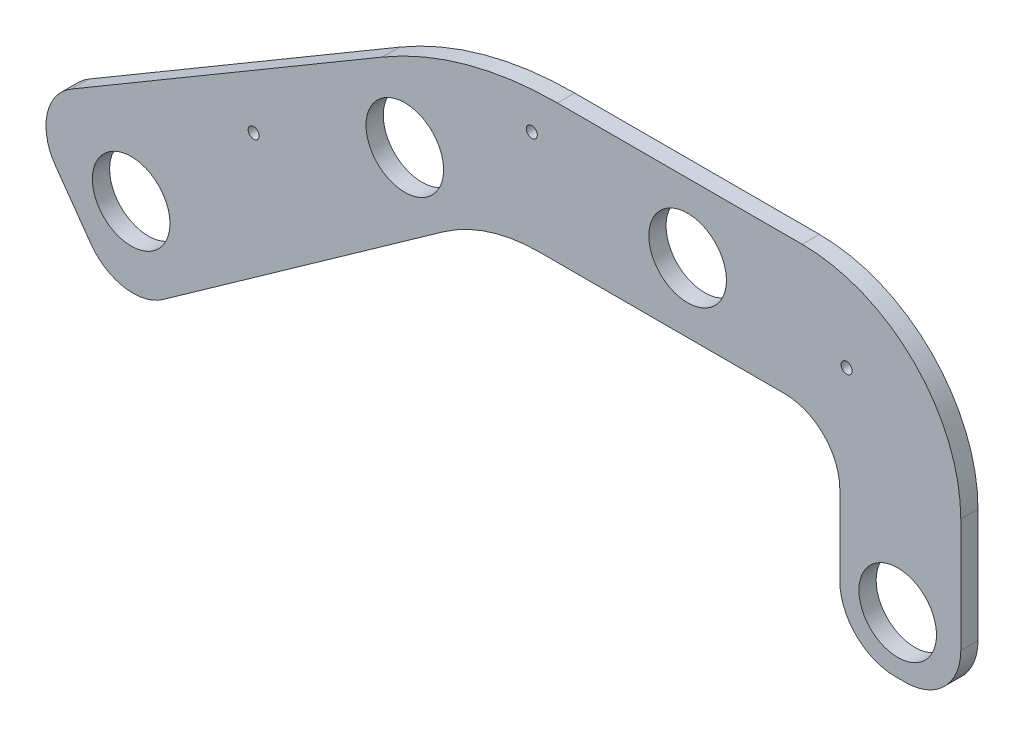
ISO-10303-21;
HEADER;
FILE_DESCRIPTION(('STEP AP214'),'2;1');
FILE_NAME('part.step','',(''),(''),'','','');
FILE_SCHEMA(('AUTOMOTIVE_DESIGN { 1 0 10303 214 1 1 1 1 }'));
ENDSEC;
DATA;
#1=APPLICATION_CONTEXT('core data for automotive mechanical design processes');
#2=APPLICATION_PROTOCOL_DEFINITION('international standard','automotive_design',2000,#1);
#3=PRODUCT_CONTEXT('',#1,'mechanical');
#4=PRODUCT('Part','Part','',(#3));
#5=PRODUCT_RELATED_PRODUCT_CATEGORY('part','',(#4));
#6=PRODUCT_DEFINITION_FORMATION('','',#4);
#7=PRODUCT_DEFINITION_CONTEXT('part definition',#1,'design');
#8=PRODUCT_DEFINITION('design','',#6,#7);
#9=PRODUCT_DEFINITION_SHAPE('','',#8);
#10=(LENGTH_UNIT() NAMED_UNIT(*) SI_UNIT(.MILLI.,.METRE.));
#11=(NAMED_UNIT(*) PLANE_ANGLE_UNIT() SI_UNIT($,.RADIAN.));
#12=(NAMED_UNIT(*) SI_UNIT($,.STERADIAN.) SOLID_ANGLE_UNIT());
#13=UNCERTAINTY_MEASURE_WITH_UNIT(LENGTH_MEASURE(1.E-05),#10,'distance_accuracy_value','');
#14=(GEOMETRIC_REPRESENTATION_CONTEXT(3) GLOBAL_UNCERTAINTY_ASSIGNED_CONTEXT((#13)) GLOBAL_UNIT_ASSIGNED_CONTEXT((#10,
#11,#12)) REPRESENTATION_CONTEXT('',''));
#15=CARTESIAN_POINT('',(0.,0.,0.));
#16=DIRECTION('',(0.,0.,1.));
#17=DIRECTION('',(1.,0.,0.));
#18=AXIS2_PLACEMENT_3D('',#15,#16,#17);
#19=CARTESIAN_POINT('',(0.,0.,3.175));
#20=DIRECTION('',(0.,1.,0.));
#21=DIRECTION('',(0.,0.,1.));
#22=AXIS2_PLACEMENT_3D('',#19,#20,#21);
#23=PLANE('',#22);
#24=DIRECTION('',(1.,0.,0.));
#25=VECTOR('',#24,1.);
#26=CARTESIAN_POINT('',(0.,0.,0.));
#27=LINE('',#26,#25);
#28=CARTESIAN_POINT('',(19.4186309210851,0.,0.));
#29=VERTEX_POINT('',#28);
#30=CARTESIAN_POINT('',(109.855,0.,0.));
#31=VERTEX_POINT('',#30);
#32=EDGE_CURVE('E276',#29,#31,#27,.T.);
#33=ORIENTED_EDGE('',*,*,#32,.T.);
#34=DIRECTION('',(0.,0.,-1.));
#35=VECTOR('',#34,1.);
#36=CARTESIAN_POINT('',(109.855,0.,6.35));
#37=LINE('',#36,#35);
#38=CARTESIAN_POINT('',(109.855,0.,6.35));
#39=VERTEX_POINT('',#38);
#40=EDGE_CURVE('E215',#31,#39,#37,.F.);
#41=ORIENTED_EDGE('',*,*,#40,.T.);
#42=DIRECTION('',(1.,0.,0.));
#43=VECTOR('',#42,1.);
#44=CARTESIAN_POINT('',(0.,0.,6.35));
#45=LINE('',#44,#43);
#46=CARTESIAN_POINT('',(19.4186309210851,0.,6.35));
#47=VERTEX_POINT('',#46);
#48=EDGE_CURVE('E306',#47,#39,#45,.T.);
#49=ORIENTED_EDGE('',*,*,#48,.F.);
#50=DIRECTION('',(0.,0.,-1.));
#51=VECTOR('',#50,1.);
#52=CARTESIAN_POINT('',(19.4186309210851,0.,0.));
#53=LINE('',#52,#51);
#54=EDGE_CURVE('E203',#47,#29,#53,.T.);
#55=ORIENTED_EDGE('',*,*,#54,.T.);
#56=EDGE_LOOP('',(#33,#41,#49,#55));
#57=FACE_BOUND('',#56,.T.);
#58=ADVANCED_FACE('F38',(#57),#23,.F.);
#59=CARTESIAN_POINT('',(130.175,0.,3.175));
#60=DIRECTION('',(1.,0.,0.));
#61=DIRECTION('',(0.,0.,-1.));
#62=AXIS2_PLACEMENT_3D('',#59,#60,#61);
#63=PLANE('',#62);
#64=DIRECTION('',(0.,-1.,0.));
#65=VECTOR('',#64,1.);
#66=CARTESIAN_POINT('',(130.175,0.,0.));
#67=LINE('',#66,#65);
#68=CARTESIAN_POINT('',(130.175,-20.32,0.));
#69=VERTEX_POINT('',#68);
#70=CARTESIAN_POINT('',(130.175,-49.53,0.));
#71=VERTEX_POINT('',#70);
#72=EDGE_CURVE('E279',#69,#71,#67,.T.);
#73=ORIENTED_EDGE('',*,*,#72,.T.);
#74=DIRECTION('',(0.,0.,-1.));
#75=VECTOR('',#74,1.);
#76=CARTESIAN_POINT('',(130.175,-49.53,3.175));
#77=LINE('',#76,#75);
#78=CARTESIAN_POINT('',(130.175,-49.53,6.35));
#79=VERTEX_POINT('',#78);
#80=EDGE_CURVE('E226',#71,#79,#77,.F.);
#81=ORIENTED_EDGE('',*,*,#80,.T.);
#82=DIRECTION('',(0.,-1.,0.));
#83=VECTOR('',#82,1.);
#84=CARTESIAN_POINT('',(130.175,0.,6.35));
#85=LINE('',#84,#83);
#86=CARTESIAN_POINT('',(130.175,-20.32,6.35));
#87=VERTEX_POINT('',#86);
#88=EDGE_CURVE('E301',#87,#79,#85,.T.);
#89=ORIENTED_EDGE('',*,*,#88,.F.);
#90=DIRECTION('',(0.,0.,-1.));
#91=VECTOR('',#90,1.);
#92=CARTESIAN_POINT('',(130.175,-20.32,0.));
#93=LINE('',#92,#91);
#94=EDGE_CURVE('E212',#87,#69,#93,.T.);
#95=ORIENTED_EDGE('',*,*,#94,.T.);
#96=EDGE_LOOP('',(#73,#81,#89,#95));
#97=FACE_BOUND('',#96,.T.);
#98=ADVANCED_FACE('F386',(#97),#63,.F.);
#99=CARTESIAN_POINT('',(130.175,-69.85,3.175));
#100=DIRECTION('',(0.,1.,0.));
#101=DIRECTION('',(0.,0.,1.));
#102=AXIS2_PLACEMENT_3D('',#99,#100,#101);
#103=PLANE('',#102);
#104=DIRECTION('',(1.,0.,0.));
#105=VECTOR('',#104,1.);
#106=CARTESIAN_POINT('',(130.175,-69.85,0.));
#107=LINE('',#106,#105);
#108=CARTESIAN_POINT('',(150.495,-69.85,0.));
#109=VERTEX_POINT('',#108);
#110=CARTESIAN_POINT('',(154.406114012222,-69.85,0.));
#111=VERTEX_POINT('',#110);
#112=EDGE_CURVE('E253',#109,#111,#107,.T.);
#113=ORIENTED_EDGE('',*,*,#112,.T.);
#114=DIRECTION('',(0.,0.,-1.));
#115=VECTOR('',#114,1.);
#116=CARTESIAN_POINT('',(154.406114012222,-69.85,3.175));
#117=LINE('',#116,#115);
#118=CARTESIAN_POINT('',(154.406114012222,-69.85,6.35));
#119=VERTEX_POINT('',#118);
#120=EDGE_CURVE('E235',#111,#119,#117,.F.);
#121=ORIENTED_EDGE('',*,*,#120,.T.);
#122=DIRECTION('',(1.,0.,0.));
#123=VECTOR('',#122,1.);
#124=CARTESIAN_POINT('',(130.175,-69.85,6.35));
#125=LINE('',#124,#123);
#126=CARTESIAN_POINT('',(150.495,-69.85,6.35));
#127=VERTEX_POINT('',#126);
#128=EDGE_CURVE('E297',#127,#119,#125,.T.);
#129=ORIENTED_EDGE('',*,*,#128,.F.);
#130=DIRECTION('',(0.,0.,-1.));
#131=VECTOR('',#130,1.);
#132=CARTESIAN_POINT('',(150.495,-69.85,3.175));
#133=LINE('',#132,#131);
#134=EDGE_CURVE('E221',#127,#109,#133,.T.);
#135=ORIENTED_EDGE('',*,*,#134,.T.);
#136=EDGE_LOOP('',(#113,#121,#129,#135));
#137=FACE_BOUND('',#136,.T.);
#138=ADVANCED_FACE('F288',(#137),#103,.F.);
#139=CARTESIAN_POINT('',(174.726114012222,-31.75,3.175));
#140=DIRECTION('',(-1.,0.,0.));
#141=DIRECTION('',(0.,0.,1.));
#142=AXIS2_PLACEMENT_3D('',#139,#140,#141);
#143=PLANE('',#142);
#144=DIRECTION('',(0.,1.,0.));
#145=VECTOR('',#144,1.);
#146=CARTESIAN_POINT('',(174.726114012222,-31.75,0.));
#147=LINE('',#146,#145);
#148=CARTESIAN_POINT('',(174.726114012222,-49.53,0.));
#149=VERTEX_POINT('',#148);
#150=CARTESIAN_POINT('',(174.726114012222,-7.55047961395594,0.));
#151=VERTEX_POINT('',#150);
#152=EDGE_CURVE('E250',#149,#151,#147,.T.);
#153=ORIENTED_EDGE('',*,*,#152,.T.);
#154=DIRECTION('',(0.,0.,-1.));
#155=VECTOR('',#154,1.);
#156=CARTESIAN_POINT('',(174.726114012222,-7.55047961395593,3.175));
#157=LINE('',#156,#155);
#158=CARTESIAN_POINT('',(174.726114012222,-7.55047961395595,6.35));
#159=VERTEX_POINT('',#158);
#160=EDGE_CURVE('E46',#151,#159,#157,.F.);
#161=ORIENTED_EDGE('',*,*,#160,.T.);
#162=DIRECTION('',(0.,1.,0.));
#163=VECTOR('',#162,1.);
#164=CARTESIAN_POINT('',(174.726114012222,-69.85,6.35));
#165=LINE('',#164,#163);
#166=CARTESIAN_POINT('',(174.726114012222,-49.53,6.35));
#167=VERTEX_POINT('',#166);
#168=EDGE_CURVE('E296',#167,#159,#165,.T.);
#169=ORIENTED_EDGE('',*,*,#168,.F.);
#170=DIRECTION('',(0.,0.,-1.));
#171=VECTOR('',#170,1.);
#172=CARTESIAN_POINT('',(174.726114012222,-49.53,3.175));
#173=LINE('',#172,#171);
#174=EDGE_CURVE('E230',#167,#149,#173,.T.);
#175=ORIENTED_EDGE('',*,*,#174,.T.);
#176=EDGE_LOOP('',(#153,#161,#169,#175));
#177=FACE_BOUND('',#176,.T.);
#178=ADVANCED_FACE('F298',(#177),#143,.F.);
#179=CARTESIAN_POINT('',(174.726114012222,50.8695203860441,3.175));
#180=DIRECTION('',(0.,-1.,0.));
#181=DIRECTION('',(1.,0.,0.));
#182=AXIS2_PLACEMENT_3D('',#179,#180,#181);
#183=PLANE('',#182);
#184=DIRECTION('',(-1.,0.,0.));
#185=VECTOR('',#184,1.);
#186=CARTESIAN_POINT('',(174.726114012222,50.8695203860441,6.35));
#187=LINE('',#186,#185);
#188=CARTESIAN_POINT('',(116.306114012222,50.8695203860441,6.35));
#189=VERTEX_POINT('',#188);
#190=CARTESIAN_POINT('',(26.1630473942683,50.8695203860441,6.35));
#191=VERTEX_POINT('',#190);
#192=EDGE_CURVE('E157',#189,#191,#187,.T.);
#193=ORIENTED_EDGE('',*,*,#192,.F.);
#194=DIRECTION('',(0.,0.,-1.));
#195=VECTOR('',#194,1.);
#196=CARTESIAN_POINT('',(116.306114012222,50.8695203860441,3.175));
#197=LINE('',#196,#195);
#198=CARTESIAN_POINT('',(116.306114012222,50.8695203860441,0.));
#199=VERTEX_POINT('',#198);
#200=EDGE_CURVE('E239',#189,#199,#197,.T.);
#201=ORIENTED_EDGE('',*,*,#200,.T.);
#202=DIRECTION('',(-1.,0.,0.));
#203=VECTOR('',#202,1.);
#204=CARTESIAN_POINT('',(174.726114012222,50.8695203860441,0.));
#205=LINE('',#204,#203);
#206=CARTESIAN_POINT('',(26.1630473942683,50.8695203860441,0.));
#207=VERTEX_POINT('',#206);
#208=EDGE_CURVE('E245',#199,#207,#205,.T.);
#209=ORIENTED_EDGE('',*,*,#208,.T.);
#210=DIRECTION('',(0.,0.,-1.));
#211=VECTOR('',#210,1.);
#212=CARTESIAN_POINT('',(26.1630473942683,50.8695203860441,3.175));
#213=LINE('',#212,#211);
#214=EDGE_CURVE('E163',#207,#191,#213,.F.);
#215=ORIENTED_EDGE('',*,*,#214,.T.);
#216=EDGE_LOOP('',(#193,#201,#209,#215));
#217=FACE_BOUND('',#216,.T.);
#218=ADVANCED_FACE('F244',(#217),#183,.F.);
#219=CARTESIAN_POINT('',(-170.69993797376,-44.6942356897263,3.175));
#220=DIRECTION('',(0.507527699518037,-0.861635441600407,0.));
#221=DIRECTION('',(0.861635441600408,0.507527699518037,0.));
#222=AXIS2_PLACEMENT_3D('',#219,#220,#221);
#223=PLANE('',#222);
#224=DIRECTION('',(-0.861635441600407,-0.507527699518037,0.));
#225=VECTOR('',#224,1.);
#226=CARTESIAN_POINT('',(-170.69993797376,-44.6942356897263,0.));
#227=LINE('',#226,#225);
#228=CARTESIAN_POINT('',(-38.2929704445223,33.2972214692958,0.));
#229=VERTEX_POINT('',#228);
#230=CARTESIAN_POINT('',(-152.83749231727,-34.1727488588628,0.));
#231=VERTEX_POINT('',#230);
#232=EDGE_CURVE('E249',#229,#231,#227,.T.);
#233=ORIENTED_EDGE('',*,*,#232,.T.);
#234=DIRECTION('',(0.,0.,-1.));
#235=VECTOR('',#234,1.);
#236=CARTESIAN_POINT('',(-152.83749231727,-34.1727488588628,3.175));
#237=LINE('',#236,#235);
#238=CARTESIAN_POINT('',(-152.83749231727,-34.1727488588628,6.35));
#239=VERTEX_POINT('',#238);
#240=EDGE_CURVE('E172',#231,#239,#237,.F.);
#241=ORIENTED_EDGE('',*,*,#240,.T.);
#242=DIRECTION('',(-0.861635441600407,-0.507527699518037,0.));
#243=VECTOR('',#242,1.);
#244=CARTESIAN_POINT('',(-170.69993797376,-44.6942356897263,6.35));
#245=LINE('',#244,#243);
#246=CARTESIAN_POINT('',(-38.2929704445223,33.2972214692958,6.35));
#247=VERTEX_POINT('',#246);
#248=EDGE_CURVE('E154',#247,#239,#245,.T.);
#249=ORIENTED_EDGE('',*,*,#248,.F.);
#250=DIRECTION('',(0.,0.,-1.));
#251=VECTOR('',#250,1.);
#252=CARTESIAN_POINT('',(-38.2929704445223,33.2972214692958,3.175));
#253=LINE('',#252,#251);
#254=EDGE_CURVE('E169',#247,#229,#253,.T.);
#255=ORIENTED_EDGE('',*,*,#254,.T.);
#256=EDGE_LOOP('',(#233,#241,#249,#255));
#257=FACE_BOUND('',#256,.T.);
#258=ADVANCED_FACE('F168',(#257),#223,.F.);
#259=CARTESIAN_POINT('',(-134.680588616307,-95.4942356897263,3.175));
#260=DIRECTION('',(0.815751596706888,0.578402396667028,0.));
#261=DIRECTION('',(-0.578402396667028,0.815751596706888,0.));
#262=AXIS2_PLACEMENT_3D('',#259,#260,#261);
#263=PLANE('',#262);
#264=DIRECTION('',(0.578402396667028,-0.815751596706888,0.));
#265=VECTOR('',#264,1.);
#266=CARTESIAN_POINT('',(-134.680588616307,-95.4942356897263,0.));
#267=LINE('',#266,#265);
#268=CARTESIAN_POINT('',(-158.709157558718,-61.6054696778575,0.));
#269=VERTEX_POINT('',#268);
#270=CARTESIAN_POINT('',(-145.699154272814,-79.9541677724601,0.));
#271=VERTEX_POINT('',#270);
#272=EDGE_CURVE('E182',#269,#271,#267,.T.);
#273=ORIENTED_EDGE('',*,*,#272,.T.);
#274=DIRECTION('',(0.,0.,-1.));
#275=VECTOR('',#274,1.);
#276=CARTESIAN_POINT('',(-145.699154272814,-79.9541677724601,3.175));
#277=LINE('',#276,#275);
#278=CARTESIAN_POINT('',(-145.699154272814,-79.9541677724601,6.35));
#279=VERTEX_POINT('',#278);
#280=EDGE_CURVE('E199',#271,#279,#277,.F.);
#281=ORIENTED_EDGE('',*,*,#280,.T.);
#282=DIRECTION('',(0.578402396667028,-0.815751596706888,0.));
#283=VECTOR('',#282,1.);
#284=CARTESIAN_POINT('',(-134.680588616307,-95.4942356897263,6.35));
#285=LINE('',#284,#283);
#286=CARTESIAN_POINT('',(-158.709157558718,-61.6054696778575,6.35));
#287=VERTEX_POINT('',#286);
#288=EDGE_CURVE('E173',#287,#279,#285,.T.);
#289=ORIENTED_EDGE('',*,*,#288,.F.);
#290=DIRECTION('',(0.,0.,-1.));
#291=VECTOR('',#290,1.);
#292=CARTESIAN_POINT('',(-158.709157558718,-61.6054696778574,3.175));
#293=LINE('',#292,#291);
#294=EDGE_CURVE('E162',#287,#269,#293,.T.);
#295=ORIENTED_EDGE('',*,*,#294,.T.);
#296=EDGE_LOOP('',(#273,#281,#289,#295));
#297=FACE_BOUND('',#296,.T.);
#298=ADVANCED_FACE('F260',(#297),#263,.F.);
#299=CARTESIAN_POINT('',(0.,0.,3.175));
#300=DIRECTION('',(-0.578402396667028,0.815751596706888,0.));
#301=DIRECTION('',(-0.815751596706888,-0.578402396667028,0.));
#302=AXIS2_PLACEMENT_3D('',#299,#300,#301);
#303=PLANE('',#302);
#304=DIRECTION('',(0.815751596706888,0.578402396667028,0.));
#305=VECTOR('',#304,1.);
#306=CARTESIAN_POINT('',(0.,0.,0.));
#307=LINE('',#306,#305);
#308=CARTESIAN_POINT('',(-119.140520699041,-84.4756700332195,0.));
#309=VERTEX_POINT('',#308);
#310=CARTESIAN_POINT('',(-15.8407791797369,-11.2317826647481,0.));
#311=VERTEX_POINT('',#310);
#312=EDGE_CURVE('E178',#309,#311,#307,.T.);
#313=ORIENTED_EDGE('',*,*,#312,.T.);
#314=DIRECTION('',(0.,0.,-1.));
#315=VECTOR('',#314,1.);
#316=CARTESIAN_POINT('',(-15.8407791797369,-11.2317826647481,6.35));
#317=LINE('',#316,#315);
#318=CARTESIAN_POINT('',(-15.8407791797369,-11.2317826647481,6.35));
#319=VERTEX_POINT('',#318);
#320=EDGE_CURVE('E206',#311,#319,#317,.F.);
#321=ORIENTED_EDGE('',*,*,#320,.T.);
#322=DIRECTION('',(0.815751596706888,0.578402396667028,0.));
#323=VECTOR('',#322,1.);
#324=CARTESIAN_POINT('',(0.,0.,6.35));
#325=LINE('',#324,#323);
#326=CARTESIAN_POINT('',(-119.140520699041,-84.4756700332195,6.35));
#327=VERTEX_POINT('',#326);
#328=EDGE_CURVE('E270',#327,#319,#325,.T.);
#329=ORIENTED_EDGE('',*,*,#328,.F.);
#330=DIRECTION('',(0.,0.,-1.));
#331=VECTOR('',#330,1.);
#332=CARTESIAN_POINT('',(-119.140520699041,-84.4756700332195,3.175));
#333=LINE('',#332,#331);
#334=EDGE_CURVE('E194',#327,#309,#333,.T.);
#335=ORIENTED_EDGE('',*,*,#334,.T.);
#336=EDGE_LOOP('',(#313,#321,#329,#335));
#337=FACE_BOUND('',#336,.T.);
#338=ADVANCED_FACE('F273',(#337),#303,.F.);
#339=CARTESIAN_POINT('',(0.,0.,0.));
#340=DIRECTION('',(0.,0.,-1.));
#341=DIRECTION('',(-1.,0.,0.));
#342=AXIS2_PLACEMENT_3D('',#339,#340,#341);
#343=PLANE('',#342);
#344=CARTESIAN_POINT('',(-30.0550304667695,8.56300737602567,0.));
#345=DIRECTION('',(0.,0.,-1.));
#346=DIRECTION('',(-1.,0.,0.));
#347=AXIS2_PLACEMENT_3D('',#344,#345,#346);
#348=CIRCLE('',#347,14.2875);
#349=CARTESIAN_POINT('',(-44.3425304667695,8.56300737602567,0.));
#350=VERTEX_POINT('',#349);
#351=EDGE_CURVE('E328',#350,#350,#348,.T.);
#352=ORIENTED_EDGE('',*,*,#351,.F.);
#353=EDGE_LOOP('',(#352));
#354=FACE_BOUND('',#353,.T.);
#355=CARTESIAN_POINT('',(151.503295523505,-49.0244770410215,0.));
#356=DIRECTION('',(0.,0.,-1.));
#357=DIRECTION('',(-1.,0.,0.));
#358=AXIS2_PLACEMENT_3D('',#355,#356,#357);
#359=CIRCLE('',#358,14.2875);
#360=CARTESIAN_POINT('',(137.215795523505,-49.0244770410215,0.));
#361=VERTEX_POINT('',#360);
#362=EDGE_CURVE('E335',#361,#361,#359,.T.);
#363=ORIENTED_EDGE('',*,*,#362,.F.);
#364=EDGE_LOOP('',(#363));
#365=FACE_BOUND('',#364,.T.);
#366=CARTESIAN_POINT('',(132.677584994468,19.6767864826342,0.));
#367=DIRECTION('',(0.,0.,-1.));
#368=DIRECTION('',(-1.,0.,0.));
#369=AXIS2_PLACEMENT_3D('',#366,#367,#368);
#370=CIRCLE('',#369,2.03200000000001);
#371=CARTESIAN_POINT('',(130.645584994468,19.6767864826342,0.));
#372=VERTEX_POINT('',#371);
#373=EDGE_CURVE('E316',#372,#372,#370,.T.);
#374=ORIENTED_EDGE('',*,*,#373,.F.);
#375=EDGE_LOOP('',(#374));
#376=FACE_BOUND('',#375,.T.);
#377=CARTESIAN_POINT('',(74.1123588019121,25.4,0.));
#378=DIRECTION('',(0.,0.,-1.));
#379=DIRECTION('',(-1.,0.,0.));
#380=AXIS2_PLACEMENT_3D('',#377,#378,#379);
#381=CIRCLE('',#380,14.2875);
#382=CARTESIAN_POINT('',(59.8248588019121,25.4,0.));
#383=VERTEX_POINT('',#382);
#384=EDGE_CURVE('E323',#383,#383,#381,.T.);
#385=ORIENTED_EDGE('',*,*,#384,.F.);
#386=EDGE_LOOP('',(#385));
#387=FACE_BOUND('',#386,.T.);
#388=CARTESIAN_POINT('',(16.7302955438089,36.9179557453165,0.));
#389=DIRECTION('',(0.,0.,-1.));
#390=DIRECTION('',(-1.,0.,0.));
#391=AXIS2_PLACEMENT_3D('',#388,#389,#390);
#392=CIRCLE('',#391,2.032);
#393=CARTESIAN_POINT('',(14.6982955438089,36.9179557453165,0.));
#394=VERTEX_POINT('',#393);
#395=EDGE_CURVE('E346',#394,#394,#392,.T.);
#396=ORIENTED_EDGE('',*,*,#395,.F.);
#397=EDGE_LOOP('',(#396));
#398=FACE_BOUND('',#397,.T.);
#399=CARTESIAN_POINT('',(-130.843837194959,-58.9846908851968,0.));
#400=DIRECTION('',(0.,0.,-1.));
#401=DIRECTION('',(-1.,0.,0.));
#402=AXIS2_PLACEMENT_3D('',#399,#400,#401);
#403=CIRCLE('',#402,14.2875);
#404=CARTESIAN_POINT('',(-145.131337194959,-58.9846908851968,0.));
#405=VERTEX_POINT('',#404);
#406=EDGE_CURVE('E340',#405,#405,#403,.T.);
#407=ORIENTED_EDGE('',*,*,#406,.F.);
#408=EDGE_LOOP('',(#407));
#409=FACE_BOUND('',#408,.T.);
#410=CARTESIAN_POINT('',(-85.7283583978798,-14.6121084220283,0.));
#411=DIRECTION('',(0.,0.,-1.));
#412=DIRECTION('',(-1.,0.,0.));
#413=AXIS2_PLACEMENT_3D('',#410,#411,#412);
#414=CIRCLE('',#413,2.03200000000001);
#415=CARTESIAN_POINT('',(-87.7603583978799,-14.6121084220283,0.));
#416=VERTEX_POINT('',#415);
#417=EDGE_CURVE('E310',#416,#416,#414,.T.);
#418=ORIENTED_EDGE('',*,*,#417,.F.);
#419=EDGE_LOOP('',(#418));
#420=FACE_BOUND('',#419,.T.);
#421=ORIENTED_EDGE('',*,*,#208,.F.);
#422=CARTESIAN_POINT('',(116.306114012222,-7.55047961395593,0.));
#423=DIRECTION('',(0.,0.,-1.));
#424=DIRECTION('',(-1.,0.,0.));
#425=AXIS2_PLACEMENT_3D('',#422,#423,#424);
#426=CIRCLE('',#425,58.42);
#427=EDGE_CURVE('E60',#199,#151,#426,.T.);
#428=ORIENTED_EDGE('',*,*,#427,.T.);
#429=ORIENTED_EDGE('',*,*,#152,.F.);
#430=CARTESIAN_POINT('',(154.406114012222,-49.53,0.));
#431=DIRECTION('',(0.,0.,-1.));
#432=DIRECTION('',(-1.,0.,0.));
#433=AXIS2_PLACEMENT_3D('',#430,#431,#432);
#434=CIRCLE('',#433,20.32);
#435=EDGE_CURVE('E233',#149,#111,#434,.T.);
#436=ORIENTED_EDGE('',*,*,#435,.T.);
#437=ORIENTED_EDGE('',*,*,#112,.F.);
#438=CARTESIAN_POINT('',(150.495,-49.53,0.));
#439=DIRECTION('',(0.,0.,-1.));
#440=DIRECTION('',(-1.,0.,0.));
#441=AXIS2_PLACEMENT_3D('',#438,#439,#440);
#442=CIRCLE('',#441,20.32);
#443=EDGE_CURVE('E224',#109,#71,#442,.T.);
#444=ORIENTED_EDGE('',*,*,#443,.T.);
#445=ORIENTED_EDGE('',*,*,#72,.F.);
#446=CARTESIAN_POINT('',(109.855,-20.32,0.));
#447=DIRECTION('',(0.,0.,-1.));
#448=DIRECTION('',(-1.,0.,0.));
#449=AXIS2_PLACEMENT_3D('',#446,#447,#448);
#450=CIRCLE('',#449,20.32);
#451=EDGE_CURVE('E217',#69,#31,#450,.F.);
#452=ORIENTED_EDGE('',*,*,#451,.T.);
#453=ORIENTED_EDGE('',*,*,#32,.F.);
#454=CARTESIAN_POINT('',(19.4186309210851,-60.96,0.));
#455=DIRECTION('',(0.,0.,-1.));
#456=DIRECTION('',(-1.,0.,0.));
#457=AXIS2_PLACEMENT_3D('',#454,#455,#456);
#458=CIRCLE('',#457,60.96);
#459=EDGE_CURVE('E208',#29,#311,#458,.F.);
#460=ORIENTED_EDGE('',*,*,#459,.T.);
#461=ORIENTED_EDGE('',*,*,#312,.F.);
#462=CARTESIAN_POINT('',(-130.159086355548,-68.9356021159532,0.));
#463=DIRECTION('',(0.,0.,-1.));
#464=DIRECTION('',(-1.,0.,0.));
#465=AXIS2_PLACEMENT_3D('',#462,#463,#464);
#466=CIRCLE('',#465,19.05);
#467=EDGE_CURVE('E197',#309,#271,#466,.T.);
#468=ORIENTED_EDGE('',*,*,#467,.T.);
#469=ORIENTED_EDGE('',*,*,#272,.F.);
#470=CARTESIAN_POINT('',(-143.169089641452,-50.5869040213505,0.));
#471=DIRECTION('',(0.,0.,-1.));
#472=DIRECTION('',(-1.,0.,0.));
#473=AXIS2_PLACEMENT_3D('',#470,#471,#472);
#474=CIRCLE('',#473,19.05);
#475=EDGE_CURVE('E189',#269,#231,#474,.T.);
#476=ORIENTED_EDGE('',*,*,#475,.T.);
#477=ORIENTED_EDGE('',*,*,#232,.F.);
#478=CARTESIAN_POINT('',(26.1630473942684,-76.1304796139559,0.));
#479=DIRECTION('',(0.,0.,-1.));
#480=DIRECTION('',(-1.,0.,0.));
#481=AXIS2_PLACEMENT_3D('',#478,#479,#480);
#482=CIRCLE('',#481,127.);
#483=EDGE_CURVE('E177',#229,#207,#482,.T.);
#484=ORIENTED_EDGE('',*,*,#483,.T.);
#485=EDGE_LOOP('',(#421,#428,#429,#436,#437,#444,#445,#452,#453,#460,#461,#468,#469,#476,#477,#484));
#486=FACE_BOUND('',#485,.T.);
#487=ADVANCED_FACE('F248',(#354,#365,#376,#387,#398,#409,#420,#486),#343,.T.);
#488=CARTESIAN_POINT('',(0.,0.,6.35));
#489=DIRECTION('',(0.,0.,-1.));
#490=DIRECTION('',(-1.,0.,0.));
#491=AXIS2_PLACEMENT_3D('',#488,#489,#490);
#492=PLANE('',#491);
#493=CARTESIAN_POINT('',(-30.0550304667695,8.56300737602567,6.35));
#494=DIRECTION('',(0.,0.,-1.));
#495=DIRECTION('',(-1.,0.,0.));
#496=AXIS2_PLACEMENT_3D('',#493,#494,#495);
#497=CIRCLE('',#496,14.2875);
#498=CARTESIAN_POINT('',(-44.3425304667695,8.56300737602567,6.35));
#499=VERTEX_POINT('',#498);
#500=EDGE_CURVE('E331',#499,#499,#497,.T.);
#501=ORIENTED_EDGE('',*,*,#500,.T.);
#502=EDGE_LOOP('',(#501));
#503=FACE_BOUND('',#502,.T.);
#504=CARTESIAN_POINT('',(151.503295523505,-49.0244770410215,6.35));
#505=DIRECTION('',(0.,0.,-1.));
#506=DIRECTION('',(-1.,0.,0.));
#507=AXIS2_PLACEMENT_3D('',#504,#505,#506);
#508=CIRCLE('',#507,14.2875);
#509=CARTESIAN_POINT('',(137.215795523505,-49.0244770410215,6.35));
#510=VERTEX_POINT('',#509);
#511=EDGE_CURVE('E320',#510,#510,#508,.T.);
#512=ORIENTED_EDGE('',*,*,#511,.T.);
#513=EDGE_LOOP('',(#512));
#514=FACE_BOUND('',#513,.T.);
#515=CARTESIAN_POINT('',(132.677584994468,19.6767864826342,6.35));
#516=DIRECTION('',(0.,0.,-1.));
#517=DIRECTION('',(-1.,0.,0.));
#518=AXIS2_PLACEMENT_3D('',#515,#516,#517);
#519=CIRCLE('',#518,2.03200000000001);
#520=CARTESIAN_POINT('',(130.645584994468,19.6767864826342,6.35));
#521=VERTEX_POINT('',#520);
#522=EDGE_CURVE('E319',#521,#521,#519,.T.);
#523=ORIENTED_EDGE('',*,*,#522,.T.);
#524=EDGE_LOOP('',(#523));
#525=FACE_BOUND('',#524,.T.);
#526=CARTESIAN_POINT('',(74.1123588019121,25.4,6.35));
#527=DIRECTION('',(0.,0.,-1.));
#528=DIRECTION('',(-1.,0.,0.));
#529=AXIS2_PLACEMENT_3D('',#526,#527,#528);
#530=CIRCLE('',#529,14.2875);
#531=CARTESIAN_POINT('',(59.8248588019121,25.4,6.35));
#532=VERTEX_POINT('',#531);
#533=EDGE_CURVE('E313',#532,#532,#530,.T.);
#534=ORIENTED_EDGE('',*,*,#533,.T.);
#535=EDGE_LOOP('',(#534));
#536=FACE_BOUND('',#535,.T.);
#537=CARTESIAN_POINT('',(16.7302955438089,36.9179557453165,6.35));
#538=DIRECTION('',(0.,0.,-1.));
#539=DIRECTION('',(-1.,0.,0.));
#540=AXIS2_PLACEMENT_3D('',#537,#538,#539);
#541=CIRCLE('',#540,2.032);
#542=CARTESIAN_POINT('',(14.6982955438089,36.9179557453165,6.35));
#543=VERTEX_POINT('',#542);
#544=EDGE_CURVE('E332',#543,#543,#541,.T.);
#545=ORIENTED_EDGE('',*,*,#544,.T.);
#546=EDGE_LOOP('',(#545));
#547=FACE_BOUND('',#546,.T.);
#548=CARTESIAN_POINT('',(-130.843837194959,-58.9846908851968,6.35));
#549=DIRECTION('',(0.,0.,-1.));
#550=DIRECTION('',(-1.,0.,0.));
#551=AXIS2_PLACEMENT_3D('',#548,#549,#550);
#552=CIRCLE('',#551,14.2875);
#553=CARTESIAN_POINT('',(-145.131337194959,-58.9846908851968,6.35));
#554=VERTEX_POINT('',#553);
#555=EDGE_CURVE('E343',#554,#554,#552,.T.);
#556=ORIENTED_EDGE('',*,*,#555,.T.);
#557=EDGE_LOOP('',(#556));
#558=FACE_BOUND('',#557,.T.);
#559=CARTESIAN_POINT('',(-85.7283583978798,-14.6121084220283,6.35));
#560=DIRECTION('',(0.,0.,-1.));
#561=DIRECTION('',(-1.,0.,0.));
#562=AXIS2_PLACEMENT_3D('',#559,#560,#561);
#563=CIRCLE('',#562,2.03200000000001);
#564=CARTESIAN_POINT('',(-87.7603583978799,-14.6121084220283,6.35));
#565=VERTEX_POINT('',#564);
#566=EDGE_CURVE('E309',#565,#565,#563,.T.);
#567=ORIENTED_EDGE('',*,*,#566,.T.);
#568=EDGE_LOOP('',(#567));
#569=FACE_BOUND('',#568,.T.);
#570=ORIENTED_EDGE('',*,*,#168,.T.);
#571=CARTESIAN_POINT('',(116.306114012222,-7.55047961395593,6.35));
#572=DIRECTION('',(0.,0.,-1.));
#573=DIRECTION('',(-1.,0.,0.));
#574=AXIS2_PLACEMENT_3D('',#571,#572,#573);
#575=CIRCLE('',#574,58.42);
#576=EDGE_CURVE('E11',#159,#189,#575,.F.);
#577=ORIENTED_EDGE('',*,*,#576,.T.);
#578=ORIENTED_EDGE('',*,*,#192,.T.);
#579=CARTESIAN_POINT('',(26.1630473942684,-76.1304796139559,6.35));
#580=DIRECTION('',(0.,0.,-1.));
#581=DIRECTION('',(-1.,0.,0.));
#582=AXIS2_PLACEMENT_3D('',#579,#580,#581);
#583=CIRCLE('',#582,127.);
#584=EDGE_CURVE('E151',#191,#247,#583,.F.);
#585=ORIENTED_EDGE('',*,*,#584,.T.);
#586=ORIENTED_EDGE('',*,*,#248,.T.);
#587=CARTESIAN_POINT('',(-143.169089641452,-50.5869040213505,6.35));
#588=DIRECTION('',(0.,0.,-1.));
#589=DIRECTION('',(-1.,0.,0.));
#590=AXIS2_PLACEMENT_3D('',#587,#588,#589);
#591=CIRCLE('',#590,19.05);
#592=EDGE_CURVE('E192',#239,#287,#591,.F.);
#593=ORIENTED_EDGE('',*,*,#592,.T.);
#594=ORIENTED_EDGE('',*,*,#288,.T.);
#595=CARTESIAN_POINT('',(-130.159086355548,-68.9356021159532,6.35));
#596=DIRECTION('',(0.,0.,-1.));
#597=DIRECTION('',(-1.,0.,0.));
#598=AXIS2_PLACEMENT_3D('',#595,#596,#597);
#599=CIRCLE('',#598,19.05);
#600=EDGE_CURVE('E201',#279,#327,#599,.F.);
#601=ORIENTED_EDGE('',*,*,#600,.T.);
#602=ORIENTED_EDGE('',*,*,#328,.T.);
#603=CARTESIAN_POINT('',(19.4186309210851,-60.96,6.35));
#604=DIRECTION('',(0.,0.,-1.));
#605=DIRECTION('',(-1.,0.,0.));
#606=AXIS2_PLACEMENT_3D('',#603,#604,#605);
#607=CIRCLE('',#606,60.96);
#608=EDGE_CURVE('E210',#319,#47,#607,.T.);
#609=ORIENTED_EDGE('',*,*,#608,.T.);
#610=ORIENTED_EDGE('',*,*,#48,.T.);
#611=CARTESIAN_POINT('',(109.855,-20.32,6.35));
#612=DIRECTION('',(0.,0.,-1.));
#613=DIRECTION('',(-1.,0.,0.));
#614=AXIS2_PLACEMENT_3D('',#611,#612,#613);
#615=CIRCLE('',#614,20.32);
#616=EDGE_CURVE('E219',#39,#87,#615,.T.);
#617=ORIENTED_EDGE('',*,*,#616,.T.);
#618=ORIENTED_EDGE('',*,*,#88,.T.);
#619=CARTESIAN_POINT('',(150.495,-49.53,6.35));
#620=DIRECTION('',(0.,0.,-1.));
#621=DIRECTION('',(-1.,0.,0.));
#622=AXIS2_PLACEMENT_3D('',#619,#620,#621);
#623=CIRCLE('',#622,20.32);
#624=EDGE_CURVE('E228',#79,#127,#623,.F.);
#625=ORIENTED_EDGE('',*,*,#624,.T.);
#626=ORIENTED_EDGE('',*,*,#128,.T.);
#627=CARTESIAN_POINT('',(154.406114012222,-49.53,6.35));
#628=DIRECTION('',(0.,0.,-1.));
#629=DIRECTION('',(-1.,0.,0.));
#630=AXIS2_PLACEMENT_3D('',#627,#628,#629);
#631=CIRCLE('',#630,20.32);
#632=EDGE_CURVE('E237',#119,#167,#631,.F.);
#633=ORIENTED_EDGE('',*,*,#632,.T.);
#634=EDGE_LOOP('',(#570,#577,#578,#585,#586,#593,#594,#601,#602,#609,#610,#617,#618,#625,#626,#633));
#635=FACE_BOUND('',#634,.T.);
#636=ADVANCED_FACE('F153',(#503,#514,#525,#536,#547,#558,#569,#635),#492,.F.);
#637=CARTESIAN_POINT('',(26.1630473942684,-76.1304796139559,3.175));
#638=DIRECTION('',(0.,0.,-1.));
#639=DIRECTION('',(-1.,0.,0.));
#640=AXIS2_PLACEMENT_3D('',#637,#638,#639);
#641=CYLINDRICAL_SURFACE('',#640,127.);
#642=ORIENTED_EDGE('',*,*,#584,.F.);
#643=ORIENTED_EDGE('',*,*,#214,.F.);
#644=ORIENTED_EDGE('',*,*,#483,.F.);
#645=ORIENTED_EDGE('',*,*,#254,.F.);
#646=EDGE_LOOP('',(#642,#643,#644,#645));
#647=FACE_BOUND('',#646,.T.);
#648=ADVANCED_FACE('F175',(#647),#641,.T.);
#649=CARTESIAN_POINT('',(-143.169089641452,-50.5869040213505,3.175));
#650=DIRECTION('',(0.,0.,-1.));
#651=DIRECTION('',(-1.,0.,0.));
#652=AXIS2_PLACEMENT_3D('',#649,#650,#651);
#653=CYLINDRICAL_SURFACE('',#652,19.05);
#654=ORIENTED_EDGE('',*,*,#592,.F.);
#655=ORIENTED_EDGE('',*,*,#240,.F.);
#656=ORIENTED_EDGE('',*,*,#475,.F.);
#657=ORIENTED_EDGE('',*,*,#294,.F.);
#658=EDGE_LOOP('',(#654,#655,#656,#657));
#659=FACE_BOUND('',#658,.T.);
#660=ADVANCED_FACE('F380',(#659),#653,.T.);
#661=CARTESIAN_POINT('',(-130.159086355548,-68.9356021159532,3.175));
#662=DIRECTION('',(0.,0.,-1.));
#663=DIRECTION('',(-1.,0.,0.));
#664=AXIS2_PLACEMENT_3D('',#661,#662,#663);
#665=CYLINDRICAL_SURFACE('',#664,19.05);
#666=ORIENTED_EDGE('',*,*,#600,.F.);
#667=ORIENTED_EDGE('',*,*,#280,.F.);
#668=ORIENTED_EDGE('',*,*,#467,.F.);
#669=ORIENTED_EDGE('',*,*,#334,.F.);
#670=EDGE_LOOP('',(#666,#667,#668,#669));
#671=FACE_BOUND('',#670,.T.);
#672=ADVANCED_FACE('F266',(#671),#665,.T.);
#673=CARTESIAN_POINT('',(-85.7283583978798,-14.6121084220283,6.35));
#674=DIRECTION('',(0.,0.,-1.));
#675=DIRECTION('',(-1.,0.,0.));
#676=AXIS2_PLACEMENT_3D('',#673,#674,#675);
#677=CYLINDRICAL_SURFACE('',#676,2.03200000000001);
#678=ORIENTED_EDGE('',*,*,#566,.F.);
#679=EDGE_LOOP('',(#678));
#680=FACE_BOUND('',#679,.T.);
#681=ORIENTED_EDGE('',*,*,#417,.T.);
#682=EDGE_LOOP('',(#681));
#683=FACE_BOUND('',#682,.T.);
#684=ADVANCED_FACE('F370',(#680,#683),#677,.F.);
#685=CARTESIAN_POINT('',(-130.843837194959,-58.9846908851968,6.35));
#686=DIRECTION('',(0.,0.,-1.));
#687=DIRECTION('',(-1.,0.,0.));
#688=AXIS2_PLACEMENT_3D('',#685,#686,#687);
#689=CYLINDRICAL_SURFACE('',#688,14.2875);
#690=ORIENTED_EDGE('',*,*,#555,.F.);
#691=EDGE_LOOP('',(#690));
#692=FACE_BOUND('',#691,.T.);
#693=ORIENTED_EDGE('',*,*,#406,.T.);
#694=EDGE_LOOP('',(#693));
#695=FACE_BOUND('',#694,.T.);
#696=ADVANCED_FACE('F358',(#692,#695),#689,.F.);
#697=CARTESIAN_POINT('',(16.7302955438089,36.9179557453165,6.35));
#698=DIRECTION('',(0.,0.,-1.));
#699=DIRECTION('',(-1.,0.,0.));
#700=AXIS2_PLACEMENT_3D('',#697,#698,#699);
#701=CYLINDRICAL_SURFACE('',#700,2.032);
#702=ORIENTED_EDGE('',*,*,#544,.F.);
#703=EDGE_LOOP('',(#702));
#704=FACE_BOUND('',#703,.T.);
#705=ORIENTED_EDGE('',*,*,#395,.T.);
#706=EDGE_LOOP('',(#705));
#707=FACE_BOUND('',#706,.T.);
#708=ADVANCED_FACE('F354',(#704,#707),#701,.F.);
#709=CARTESIAN_POINT('',(74.1123588019121,25.4,6.35));
#710=DIRECTION('',(0.,0.,-1.));
#711=DIRECTION('',(-1.,0.,0.));
#712=AXIS2_PLACEMENT_3D('',#709,#710,#711);
#713=CYLINDRICAL_SURFACE('',#712,14.2875);
#714=ORIENTED_EDGE('',*,*,#533,.F.);
#715=EDGE_LOOP('',(#714));
#716=FACE_BOUND('',#715,.T.);
#717=ORIENTED_EDGE('',*,*,#384,.T.);
#718=EDGE_LOOP('',(#717));
#719=FACE_BOUND('',#718,.T.);
#720=ADVANCED_FACE('F357',(#716,#719),#713,.F.);
#721=CARTESIAN_POINT('',(132.677584994468,19.6767864826342,6.35));
#722=DIRECTION('',(0.,0.,-1.));
#723=DIRECTION('',(-1.,0.,0.));
#724=AXIS2_PLACEMENT_3D('',#721,#722,#723);
#725=CYLINDRICAL_SURFACE('',#724,2.03200000000001);
#726=ORIENTED_EDGE('',*,*,#522,.F.);
#727=EDGE_LOOP('',(#726));
#728=FACE_BOUND('',#727,.T.);
#729=ORIENTED_EDGE('',*,*,#373,.T.);
#730=EDGE_LOOP('',(#729));
#731=FACE_BOUND('',#730,.T.);
#732=ADVANCED_FACE('F527',(#728,#731),#725,.F.);
#733=CARTESIAN_POINT('',(151.503295523505,-49.0244770410215,6.35));
#734=DIRECTION('',(0.,0.,-1.));
#735=DIRECTION('',(-1.,0.,0.));
#736=AXIS2_PLACEMENT_3D('',#733,#734,#735);
#737=CYLINDRICAL_SURFACE('',#736,14.2875);
#738=ORIENTED_EDGE('',*,*,#511,.F.);
#739=EDGE_LOOP('',(#738));
#740=FACE_BOUND('',#739,.T.);
#741=ORIENTED_EDGE('',*,*,#362,.T.);
#742=EDGE_LOOP('',(#741));
#743=FACE_BOUND('',#742,.T.);
#744=ADVANCED_FACE('F517',(#740,#743),#737,.F.);
#745=CARTESIAN_POINT('',(-30.0550304667695,8.56300737602567,6.35));
#746=DIRECTION('',(0.,0.,-1.));
#747=DIRECTION('',(-1.,0.,0.));
#748=AXIS2_PLACEMENT_3D('',#745,#746,#747);
#749=CYLINDRICAL_SURFACE('',#748,14.2875);
#750=ORIENTED_EDGE('',*,*,#500,.F.);
#751=EDGE_LOOP('',(#750));
#752=FACE_BOUND('',#751,.T.);
#753=ORIENTED_EDGE('',*,*,#351,.T.);
#754=EDGE_LOOP('',(#753));
#755=FACE_BOUND('',#754,.T.);
#756=ADVANCED_FACE('F405',(#752,#755),#749,.F.);
#757=CARTESIAN_POINT('',(19.4186309210851,-60.96,3.175));
#758=DIRECTION('',(0.,0.,1.));
#759=DIRECTION('',(1.,0.,0.));
#760=AXIS2_PLACEMENT_3D('',#757,#758,#759);
#761=CYLINDRICAL_SURFACE('',#760,60.96);
#762=ORIENTED_EDGE('',*,*,#608,.F.);
#763=ORIENTED_EDGE('',*,*,#320,.F.);
#764=ORIENTED_EDGE('',*,*,#459,.F.);
#765=ORIENTED_EDGE('',*,*,#54,.F.);
#766=EDGE_LOOP('',(#762,#763,#764,#765));
#767=FACE_BOUND('',#766,.T.);
#768=ADVANCED_FACE('F401',(#767),#761,.F.);
#769=CARTESIAN_POINT('',(109.855,-20.32,3.175));
#770=DIRECTION('',(0.,0.,1.));
#771=DIRECTION('',(1.,0.,0.));
#772=AXIS2_PLACEMENT_3D('',#769,#770,#771);
#773=CYLINDRICAL_SURFACE('',#772,20.32);
#774=ORIENTED_EDGE('',*,*,#616,.F.);
#775=ORIENTED_EDGE('',*,*,#40,.F.);
#776=ORIENTED_EDGE('',*,*,#451,.F.);
#777=ORIENTED_EDGE('',*,*,#94,.F.);
#778=EDGE_LOOP('',(#774,#775,#776,#777));
#779=FACE_BOUND('',#778,.T.);
#780=ADVANCED_FACE('F404',(#779),#773,.F.);
#781=CARTESIAN_POINT('',(150.495,-49.53,3.175));
#782=DIRECTION('',(0.,0.,-1.));
#783=DIRECTION('',(-1.,0.,0.));
#784=AXIS2_PLACEMENT_3D('',#781,#782,#783);
#785=CYLINDRICAL_SURFACE('',#784,20.32);
#786=ORIENTED_EDGE('',*,*,#624,.F.);
#787=ORIENTED_EDGE('',*,*,#80,.F.);
#788=ORIENTED_EDGE('',*,*,#443,.F.);
#789=ORIENTED_EDGE('',*,*,#134,.F.);
#790=EDGE_LOOP('',(#786,#787,#788,#789));
#791=FACE_BOUND('',#790,.T.);
#792=ADVANCED_FACE('F409',(#791),#785,.T.);
#793=CARTESIAN_POINT('',(154.406114012222,-49.53,3.175));
#794=DIRECTION('',(0.,0.,-1.));
#795=DIRECTION('',(-1.,0.,0.));
#796=AXIS2_PLACEMENT_3D('',#793,#794,#795);
#797=CYLINDRICAL_SURFACE('',#796,20.32);
#798=ORIENTED_EDGE('',*,*,#632,.F.);
#799=ORIENTED_EDGE('',*,*,#120,.F.);
#800=ORIENTED_EDGE('',*,*,#435,.F.);
#801=ORIENTED_EDGE('',*,*,#174,.F.);
#802=EDGE_LOOP('',(#798,#799,#800,#801));
#803=FACE_BOUND('',#802,.T.);
#804=ADVANCED_FACE('F294',(#803),#797,.T.);
#805=CARTESIAN_POINT('',(116.306114012222,-7.55047961395593,3.175));
#806=DIRECTION('',(0.,0.,-1.));
#807=DIRECTION('',(-1.,0.,0.));
#808=AXIS2_PLACEMENT_3D('',#805,#806,#807);
#809=CYLINDRICAL_SURFACE('',#808,58.42);
#810=ORIENTED_EDGE('',*,*,#576,.F.);
#811=ORIENTED_EDGE('',*,*,#160,.F.);
#812=ORIENTED_EDGE('',*,*,#427,.F.);
#813=ORIENTED_EDGE('',*,*,#200,.F.);
#814=EDGE_LOOP('',(#810,#811,#812,#813));
#815=FACE_BOUND('',#814,.T.);
#816=ADVANCED_FACE('F40',(#815),#809,.T.);
#817=CLOSED_SHELL('',(#58,#98,#138,#178,#218,#258,#298,#338,#487,#636,#648,#660,#672,#684,#696,
#708,#720,#732,#744,#756,#768,#780,#792,#804,#816));
#818=MANIFOLD_SOLID_BREP('B2',#817);
#819=ADVANCED_BREP_SHAPE_REPRESENTATION('',(#18,#818),#14);
#820=SHAPE_DEFINITION_REPRESENTATION(#9,#819);
ENDSEC;
END-ISO-10303-21;
